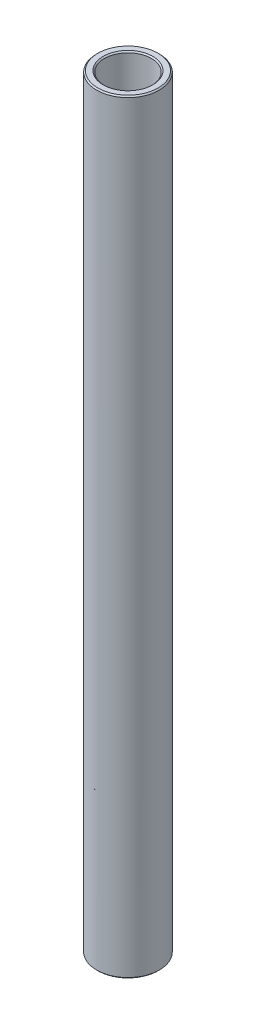
ISO-10303-21;
HEADER;
FILE_DESCRIPTION(('STEP AP214'),'2;1');
FILE_NAME('part.step','',(''),(''),'','','');
FILE_SCHEMA(('AUTOMOTIVE_DESIGN { 1 0 10303 214 1 1 1 1 }'));
ENDSEC;
DATA;
#1=APPLICATION_CONTEXT('core data for automotive mechanical design processes');
#2=APPLICATION_PROTOCOL_DEFINITION('international standard','automotive_design',2000,#1);
#3=PRODUCT_CONTEXT('',#1,'mechanical');
#4=PRODUCT('Part','Part','',(#3));
#5=PRODUCT_RELATED_PRODUCT_CATEGORY('part','',(#4));
#6=PRODUCT_DEFINITION_FORMATION('','',#4);
#7=PRODUCT_DEFINITION_CONTEXT('part definition',#1,'design');
#8=PRODUCT_DEFINITION('design','',#6,#7);
#9=PRODUCT_DEFINITION_SHAPE('','',#8);
#10=(LENGTH_UNIT() NAMED_UNIT(*) SI_UNIT(.MILLI.,.METRE.));
#11=(NAMED_UNIT(*) PLANE_ANGLE_UNIT() SI_UNIT($,.RADIAN.));
#12=(NAMED_UNIT(*) SI_UNIT($,.STERADIAN.) SOLID_ANGLE_UNIT());
#13=UNCERTAINTY_MEASURE_WITH_UNIT(LENGTH_MEASURE(1.E-05),#10,'distance_accuracy_value','');
#14=(GEOMETRIC_REPRESENTATION_CONTEXT(3) GLOBAL_UNCERTAINTY_ASSIGNED_CONTEXT((#13)) GLOBAL_UNIT_ASSIGNED_CONTEXT((#10,
#11,#12)) REPRESENTATION_CONTEXT('',''));
#15=CARTESIAN_POINT('',(0.,0.,0.));
#16=DIRECTION('',(0.,0.,1.));
#17=DIRECTION('',(1.,0.,0.));
#18=AXIS2_PLACEMENT_3D('',#15,#16,#17);
#19=CARTESIAN_POINT('',(0.,11.60859375,0.));
#20=DIRECTION('',(0.,1.,0.));
#21=DIRECTION('',(-1.,0.,0.));
#22=AXIS2_PLACEMENT_3D('',#19,#20,#21);
#23=CYLINDRICAL_SURFACE('',#22,4.7625);
#24=CARTESIAN_POINT('',(0.,-77.136625,0.));
#25=DIRECTION('',(0.,1.,0.));
#26=DIRECTION('',(-1.,0.,0.));
#27=AXIS2_PLACEMENT_3D('',#24,#25,#26);
#28=CIRCLE('',#27,4.7625);
#29=CARTESIAN_POINT('',(-4.7625,-77.136625,0.));
#30=VERTEX_POINT('',#29);
#31=EDGE_CURVE('E50',#30,#30,#28,.F.);
#32=ORIENTED_EDGE('',*,*,#31,.T.);
#33=EDGE_LOOP('',(#32));
#34=FACE_BOUND('',#33,.T.);
#35=CARTESIAN_POINT('',(0.,77.136625,0.));
#36=DIRECTION('',(0.,-1.,0.));
#37=DIRECTION('',(1.,0.,0.));
#38=AXIS2_PLACEMENT_3D('',#35,#36,#37);
#39=CIRCLE('',#38,4.7625);
#40=CARTESIAN_POINT('',(4.76250000000001,77.136625,0.));
#41=VERTEX_POINT('',#40);
#42=EDGE_CURVE('E53',#41,#41,#39,.F.);
#43=ORIENTED_EDGE('',*,*,#42,.T.);
#44=EDGE_LOOP('',(#43));
#45=FACE_BOUND('',#44,.T.);
#46=ADVANCED_FACE('F30',(#34,#45),#23,.F.);
#47=CARTESIAN_POINT('',(4.76249999999999,77.390625,0.));
#48=DIRECTION('',(0.,-1.,0.));
#49=DIRECTION('',(1.,0.,0.));
#50=AXIS2_PLACEMENT_3D('',#47,#48,#49);
#51=PLANE('',#50);
#52=CARTESIAN_POINT('',(0.,77.390625,0.));
#53=DIRECTION('',(0.,-1.,0.));
#54=DIRECTION('',(1.,0.,0.));
#55=AXIS2_PLACEMENT_3D('',#52,#53,#54);
#56=CIRCLE('',#55,6.09599999999999);
#57=CARTESIAN_POINT('',(6.096,77.390625,0.));
#58=VERTEX_POINT('',#57);
#59=EDGE_CURVE('E10',#58,#58,#56,.F.);
#60=ORIENTED_EDGE('',*,*,#59,.T.);
#61=EDGE_LOOP('',(#60));
#62=FACE_BOUND('',#61,.T.);
#63=CARTESIAN_POINT('',(0.,77.390625,0.));
#64=DIRECTION('',(0.,-1.,0.));
#65=DIRECTION('',(1.,0.,0.));
#66=AXIS2_PLACEMENT_3D('',#63,#64,#65);
#67=CIRCLE('',#66,5.01650000000001);
#68=CARTESIAN_POINT('',(5.01650000000002,77.390625,0.));
#69=VERTEX_POINT('',#68);
#70=EDGE_CURVE('E37',#69,#69,#67,.T.);
#71=ORIENTED_EDGE('',*,*,#70,.T.);
#72=EDGE_LOOP('',(#71));
#73=FACE_BOUND('',#72,.T.);
#74=ADVANCED_FACE('F76',(#62,#73),#51,.F.);
#75=CARTESIAN_POINT('',(0.,11.60859375,0.));
#76=DIRECTION('',(0.,1.,0.));
#77=DIRECTION('',(-1.,0.,0.));
#78=AXIS2_PLACEMENT_3D('',#75,#76,#77);
#79=CYLINDRICAL_SURFACE('',#78,6.35);
#80=CARTESIAN_POINT('',(0.,-77.136625,0.));
#81=DIRECTION('',(0.,1.,0.));
#82=DIRECTION('',(-1.,0.,0.));
#83=AXIS2_PLACEMENT_3D('',#80,#81,#82);
#84=CIRCLE('',#83,6.35);
#85=CARTESIAN_POINT('',(-6.35000000000001,-77.136625,0.));
#86=VERTEX_POINT('',#85);
#87=EDGE_CURVE('E41',#86,#86,#84,.T.);
#88=ORIENTED_EDGE('',*,*,#87,.T.);
#89=EDGE_LOOP('',(#88));
#90=FACE_BOUND('',#89,.T.);
#91=CARTESIAN_POINT('',(0.,77.136625,0.));
#92=DIRECTION('',(0.,-1.,0.));
#93=DIRECTION('',(1.,0.,0.));
#94=AXIS2_PLACEMENT_3D('',#91,#92,#93);
#95=CIRCLE('',#94,6.35);
#96=CARTESIAN_POINT('',(6.35000000000001,77.136625,0.));
#97=VERTEX_POINT('',#96);
#98=EDGE_CURVE('E45',#97,#97,#95,.T.);
#99=ORIENTED_EDGE('',*,*,#98,.T.);
#100=EDGE_LOOP('',(#99));
#101=FACE_BOUND('',#100,.T.);
#102=ADVANCED_FACE('F73',(#90,#101),#79,.T.);
#103=CARTESIAN_POINT('',(6.35000000000001,-77.390625,0.));
#104=DIRECTION('',(0.,1.,0.));
#105=DIRECTION('',(-1.,0.,0.));
#106=AXIS2_PLACEMENT_3D('',#103,#104,#105);
#107=PLANE('',#106);
#108=CARTESIAN_POINT('',(0.,-77.390625,0.));
#109=DIRECTION('',(0.,1.,0.));
#110=DIRECTION('',(-1.,0.,0.));
#111=AXIS2_PLACEMENT_3D('',#108,#109,#110);
#112=CIRCLE('',#111,5.01650000000002);
#113=CARTESIAN_POINT('',(-5.01650000000003,-77.390625,0.));
#114=VERTEX_POINT('',#113);
#115=EDGE_CURVE('E56',#114,#114,#112,.T.);
#116=ORIENTED_EDGE('',*,*,#115,.T.);
#117=EDGE_LOOP('',(#116));
#118=FACE_BOUND('',#117,.T.);
#119=CARTESIAN_POINT('',(0.,-77.390625,0.));
#120=DIRECTION('',(0.,1.,0.));
#121=DIRECTION('',(-1.,0.,0.));
#122=AXIS2_PLACEMENT_3D('',#119,#120,#121);
#123=CIRCLE('',#122,6.09600000000003);
#124=CARTESIAN_POINT('',(-6.09600000000004,-77.390625,0.));
#125=VERTEX_POINT('',#124);
#126=EDGE_CURVE('E59',#125,#125,#123,.F.);
#127=ORIENTED_EDGE('',*,*,#126,.T.);
#128=EDGE_LOOP('',(#127));
#129=FACE_BOUND('',#128,.T.);
#130=ADVANCED_FACE('F63',(#118,#129),#107,.F.);
#131=CARTESIAN_POINT('',(0.,-77.390625,0.));
#132=DIRECTION('',(0.,-1.,0.));
#133=DIRECTION('',(1.,0.,0.));
#134=AXIS2_PLACEMENT_3D('',#131,#132,#133);
#135=CONICAL_SURFACE('',#134,5.01650000000002,0.785398163397433);
#136=ORIENTED_EDGE('',*,*,#31,.F.);
#137=EDGE_LOOP('',(#136));
#138=FACE_BOUND('',#137,.T.);
#139=ORIENTED_EDGE('',*,*,#115,.F.);
#140=EDGE_LOOP('',(#139));
#141=FACE_BOUND('',#140,.T.);
#142=ADVANCED_FACE('F69',(#138,#141),#135,.F.);
#143=CARTESIAN_POINT('',(0.,-77.136625,0.));
#144=DIRECTION('',(0.,1.,0.));
#145=DIRECTION('',(-1.,0.,0.));
#146=AXIS2_PLACEMENT_3D('',#143,#144,#145);
#147=CONICAL_SURFACE('',#146,6.35,0.785398163397462);
#148=ORIENTED_EDGE('',*,*,#126,.F.);
#149=EDGE_LOOP('',(#148));
#150=FACE_BOUND('',#149,.T.);
#151=ORIENTED_EDGE('',*,*,#87,.F.);
#152=EDGE_LOOP('',(#151));
#153=FACE_BOUND('',#152,.T.);
#154=ADVANCED_FACE('F65',(#150,#153),#147,.T.);
#155=CARTESIAN_POINT('',(0.,77.390625,0.));
#156=DIRECTION('',(0.,-1.,0.));
#157=DIRECTION('',(1.,0.,0.));
#158=AXIS2_PLACEMENT_3D('',#155,#156,#157);
#159=CONICAL_SURFACE('',#158,6.09599999999999,0.785398163397462);
#160=ORIENTED_EDGE('',*,*,#98,.F.);
#161=EDGE_LOOP('',(#160));
#162=FACE_BOUND('',#161,.T.);
#163=ORIENTED_EDGE('',*,*,#59,.F.);
#164=EDGE_LOOP('',(#163));
#165=FACE_BOUND('',#164,.T.);
#166=ADVANCED_FACE('F68',(#162,#165),#159,.T.);
#167=CARTESIAN_POINT('',(0.,77.136625,0.));
#168=DIRECTION('',(0.,1.,0.));
#169=DIRECTION('',(-1.,0.,0.));
#170=AXIS2_PLACEMENT_3D('',#167,#168,#169);
#171=CONICAL_SURFACE('',#170,4.7625,0.78539816339746);
#172=ORIENTED_EDGE('',*,*,#70,.F.);
#173=EDGE_LOOP('',(#172));
#174=FACE_BOUND('',#173,.T.);
#175=ORIENTED_EDGE('',*,*,#42,.F.);
#176=EDGE_LOOP('',(#175));
#177=FACE_BOUND('',#176,.T.);
#178=ADVANCED_FACE('F32',(#174,#177),#171,.F.);
#179=CLOSED_SHELL('',(#46,#74,#102,#130,#142,#154,#166,#178));
#180=MANIFOLD_SOLID_BREP('B2',#179);
#181=ADVANCED_BREP_SHAPE_REPRESENTATION('',(#18,#180),#14);
#182=SHAPE_DEFINITION_REPRESENTATION(#9,#181);
ENDSEC;
END-ISO-10303-21;
